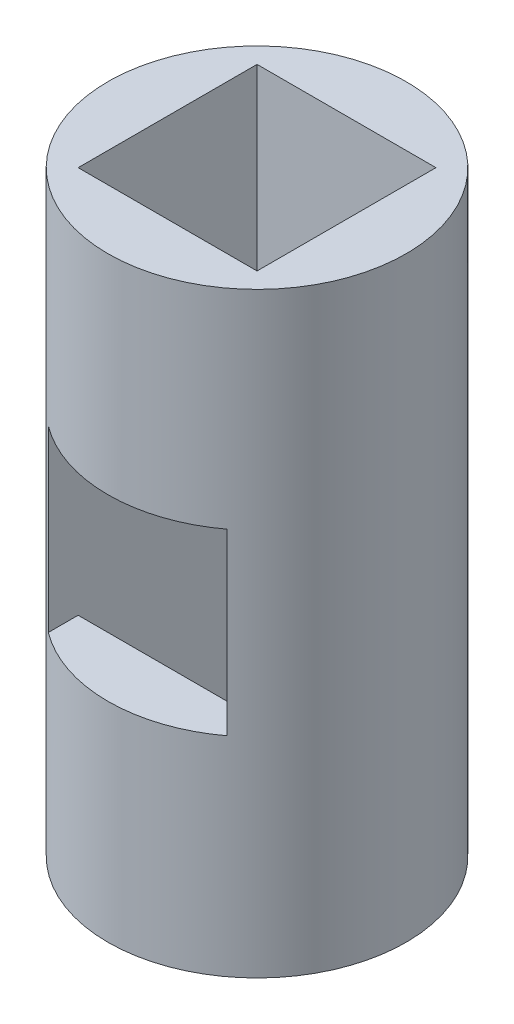
ISO-10303-21;
HEADER;
FILE_DESCRIPTION(('STEP AP214'),'2;1');
FILE_NAME('part.step','',(''),(''),'','','');
FILE_SCHEMA(('AUTOMOTIVE_DESIGN { 1 0 10303 214 1 1 1 1 }'));
ENDSEC;
DATA;
#1=APPLICATION_CONTEXT('core data for automotive mechanical design processes');
#2=APPLICATION_PROTOCOL_DEFINITION('international standard','automotive_design',2000,#1);
#3=PRODUCT_CONTEXT('',#1,'mechanical');
#4=PRODUCT('Part','Part','',(#3));
#5=PRODUCT_RELATED_PRODUCT_CATEGORY('part','',(#4));
#6=PRODUCT_DEFINITION_FORMATION('','',#4);
#7=PRODUCT_DEFINITION_CONTEXT('part definition',#1,'design');
#8=PRODUCT_DEFINITION('design','',#6,#7);
#9=PRODUCT_DEFINITION_SHAPE('','',#8);
#10=(LENGTH_UNIT() NAMED_UNIT(*) SI_UNIT(.MILLI.,.METRE.));
#11=(NAMED_UNIT(*) PLANE_ANGLE_UNIT() SI_UNIT($,.RADIAN.));
#12=(NAMED_UNIT(*) SI_UNIT($,.STERADIAN.) SOLID_ANGLE_UNIT());
#13=UNCERTAINTY_MEASURE_WITH_UNIT(LENGTH_MEASURE(1.E-05),#10,'distance_accuracy_value','');
#14=(GEOMETRIC_REPRESENTATION_CONTEXT(3) GLOBAL_UNCERTAINTY_ASSIGNED_CONTEXT((#13)) GLOBAL_UNIT_ASSIGNED_CONTEXT((#10,
#11,#12)) REPRESENTATION_CONTEXT('',''));
#15=CARTESIAN_POINT('',(0.,0.,0.));
#16=DIRECTION('',(0.,0.,1.));
#17=DIRECTION('',(1.,0.,0.));
#18=AXIS2_PLACEMENT_3D('',#15,#16,#17);
#19=CARTESIAN_POINT('',(-15.,0.,15.));
#20=DIRECTION('',(0.,0.,-1.));
#21=DIRECTION('',(-1.,0.,0.));
#22=AXIS2_PLACEMENT_3D('',#19,#20,#21);
#23=PLANE('',#22);
#24=DIRECTION('',(1.,0.,0.));
#25=VECTOR('',#24,1.);
#26=CARTESIAN_POINT('',(15.,65.,15.));
#27=LINE('',#26,#25);
#28=CARTESIAN_POINT('',(-15.,65.,15.));
#29=VERTEX_POINT('',#28);
#30=CARTESIAN_POINT('',(15.,65.,15.));
#31=VERTEX_POINT('',#30);
#32=EDGE_CURVE('E99',#29,#31,#27,.T.);
#33=ORIENTED_EDGE('',*,*,#32,.F.);
#34=DIRECTION('',(0.,1.,0.));
#35=VECTOR('',#34,1.);
#36=CARTESIAN_POINT('',(-15.,0.,15.));
#37=LINE('',#36,#35);
#38=CARTESIAN_POINT('',(-15.,100.,15.));
#39=VERTEX_POINT('',#38);
#40=EDGE_CURVE('E77',#29,#39,#37,.T.);
#41=ORIENTED_EDGE('',*,*,#40,.T.);
#42=DIRECTION('',(1.,0.,0.));
#43=VECTOR('',#42,1.);
#44=CARTESIAN_POINT('',(-15.,100.,15.));
#45=LINE('',#44,#43);
#46=CARTESIAN_POINT('',(15.,100.,15.));
#47=VERTEX_POINT('',#46);
#48=EDGE_CURVE('E224',#39,#47,#45,.T.);
#49=ORIENTED_EDGE('',*,*,#48,.T.);
#50=DIRECTION('',(0.,1.,0.));
#51=VECTOR('',#50,1.);
#52=CARTESIAN_POINT('',(15.,0.,15.));
#53=LINE('',#52,#51);
#54=EDGE_CURVE('E248',#31,#47,#53,.T.);
#55=ORIENTED_EDGE('',*,*,#54,.F.);
#56=EDGE_LOOP('',(#33,#41,#49,#55));
#57=FACE_BOUND('',#56,.T.);
#58=ADVANCED_FACE('F73',(#57),#23,.T.);
#59=CARTESIAN_POINT('',(-15.,0.,-15.));
#60=DIRECTION('',(0.,0.,1.));
#61=DIRECTION('',(1.,0.,0.));
#62=AXIS2_PLACEMENT_3D('',#59,#60,#61);
#63=PLANE('',#62);
#64=DIRECTION('',(1.,0.,0.));
#65=VECTOR('',#64,1.);
#66=CARTESIAN_POINT('',(-15.,35.,-15.));
#67=LINE('',#66,#65);
#68=CARTESIAN_POINT('',(-15.,35.,-15.));
#69=VERTEX_POINT('',#68);
#70=CARTESIAN_POINT('',(15.,35.,-15.));
#71=VERTEX_POINT('',#70);
#72=EDGE_CURVE('E210',#69,#71,#67,.T.);
#73=ORIENTED_EDGE('',*,*,#72,.F.);
#74=DIRECTION('',(0.,1.,0.));
#75=VECTOR('',#74,1.);
#76=CARTESIAN_POINT('',(-15.,0.,-15.));
#77=LINE('',#76,#75);
#78=CARTESIAN_POINT('',(-15.,0.,-15.));
#79=VERTEX_POINT('',#78);
#80=EDGE_CURVE('E247',#79,#69,#77,.T.);
#81=ORIENTED_EDGE('',*,*,#80,.F.);
#82=DIRECTION('',(1.,0.,0.));
#83=VECTOR('',#82,1.);
#84=CARTESIAN_POINT('',(-15.,0.,-15.));
#85=LINE('',#84,#83);
#86=CARTESIAN_POINT('',(15.,0.,-15.));
#87=VERTEX_POINT('',#86);
#88=EDGE_CURVE('E240',#79,#87,#85,.T.);
#89=ORIENTED_EDGE('',*,*,#88,.T.);
#90=DIRECTION('',(0.,1.,0.));
#91=VECTOR('',#90,1.);
#92=CARTESIAN_POINT('',(15.,0.,-15.));
#93=LINE('',#92,#91);
#94=EDGE_CURVE('E234',#87,#71,#93,.T.);
#95=ORIENTED_EDGE('',*,*,#94,.T.);
#96=EDGE_LOOP('',(#73,#81,#89,#95));
#97=FACE_BOUND('',#96,.T.);
#98=ADVANCED_FACE('F311',(#97),#63,.T.);
#99=CARTESIAN_POINT('',(0.,100.,0.));
#100=DIRECTION('',(0.,1.,0.));
#101=DIRECTION('',(0.,0.,1.));
#102=AXIS2_PLACEMENT_3D('',#99,#100,#101);
#103=PLANE('',#102);
#104=CARTESIAN_POINT('',(0.,100.,0.));
#105=DIRECTION('',(0.,1.,0.));
#106=DIRECTION('',(0.,0.,1.));
#107=AXIS2_PLACEMENT_3D('',#104,#105,#106);
#108=CIRCLE('',#107,25.);
#109=CARTESIAN_POINT('',(0.,100.,25.));
#110=VERTEX_POINT('',#109);
#111=EDGE_CURVE('E12',#110,#110,#108,.T.);
#112=ORIENTED_EDGE('',*,*,#111,.T.);
#113=EDGE_LOOP('',(#112));
#114=FACE_BOUND('',#113,.T.);
#115=DIRECTION('',(0.,0.,1.));
#116=VECTOR('',#115,1.);
#117=CARTESIAN_POINT('',(-15.,100.,-15.));
#118=LINE('',#117,#116);
#119=CARTESIAN_POINT('',(-15.,100.,-15.));
#120=VERTEX_POINT('',#119);
#121=EDGE_CURVE('E227',#120,#39,#118,.T.);
#122=ORIENTED_EDGE('',*,*,#121,.F.);
#123=DIRECTION('',(-1.,0.,0.));
#124=VECTOR('',#123,1.);
#125=CARTESIAN_POINT('',(-15.,100.,-15.));
#126=LINE('',#125,#124);
#127=CARTESIAN_POINT('',(15.,100.,-15.));
#128=VERTEX_POINT('',#127);
#129=EDGE_CURVE('E230',#128,#120,#126,.T.);
#130=ORIENTED_EDGE('',*,*,#129,.F.);
#131=DIRECTION('',(0.,0.,-1.));
#132=VECTOR('',#131,1.);
#133=CARTESIAN_POINT('',(15.,100.,-15.));
#134=LINE('',#133,#132);
#135=EDGE_CURVE('E254',#47,#128,#134,.T.);
#136=ORIENTED_EDGE('',*,*,#135,.F.);
#137=ORIENTED_EDGE('',*,*,#48,.F.);
#138=EDGE_LOOP('',(#122,#130,#136,#137));
#139=FACE_BOUND('',#138,.T.);
#140=ADVANCED_FACE('F294',(#114,#139),#103,.T.);
#141=CARTESIAN_POINT('',(0.,0.,0.));
#142=DIRECTION('',(0.,1.,0.));
#143=DIRECTION('',(0.,0.,1.));
#144=AXIS2_PLACEMENT_3D('',#141,#142,#143);
#145=PLANE('',#144);
#146=CARTESIAN_POINT('',(0.,0.,0.));
#147=DIRECTION('',(0.,1.,0.));
#148=DIRECTION('',(0.,0.,1.));
#149=AXIS2_PLACEMENT_3D('',#146,#147,#148);
#150=CIRCLE('',#149,25.);
#151=CARTESIAN_POINT('',(0.,0.,25.));
#152=VERTEX_POINT('',#151);
#153=EDGE_CURVE('E83',#152,#152,#150,.T.);
#154=ORIENTED_EDGE('',*,*,#153,.F.);
#155=EDGE_LOOP('',(#154));
#156=FACE_BOUND('',#155,.T.);
#157=ORIENTED_EDGE('',*,*,#88,.F.);
#158=DIRECTION('',(0.,0.,-1.));
#159=VECTOR('',#158,1.);
#160=CARTESIAN_POINT('',(-15.,0.,-15.));
#161=LINE('',#160,#159);
#162=CARTESIAN_POINT('',(-15.,0.,15.));
#163=VERTEX_POINT('',#162);
#164=EDGE_CURVE('E279',#163,#79,#161,.T.);
#165=ORIENTED_EDGE('',*,*,#164,.F.);
#166=DIRECTION('',(-1.,0.,0.));
#167=VECTOR('',#166,1.);
#168=CARTESIAN_POINT('',(-15.,0.,15.));
#169=LINE('',#168,#167);
#170=CARTESIAN_POINT('',(15.,0.,15.));
#171=VERTEX_POINT('',#170);
#172=EDGE_CURVE('E261',#171,#163,#169,.T.);
#173=ORIENTED_EDGE('',*,*,#172,.F.);
#174=DIRECTION('',(0.,0.,1.));
#175=VECTOR('',#174,1.);
#176=CARTESIAN_POINT('',(15.,0.,-15.));
#177=LINE('',#176,#175);
#178=EDGE_CURVE('E256',#87,#171,#177,.T.);
#179=ORIENTED_EDGE('',*,*,#178,.F.);
#180=EDGE_LOOP('',(#157,#165,#173,#179));
#181=FACE_BOUND('',#180,.T.);
#182=ADVANCED_FACE('F338',(#156,#181),#145,.F.);
#183=CARTESIAN_POINT('',(0.,100.,0.));
#184=DIRECTION('',(0.,-1.,0.));
#185=DIRECTION('',(0.,0.,-1.));
#186=AXIS2_PLACEMENT_3D('',#183,#184,#185);
#187=CYLINDRICAL_SURFACE('',#186,25.);
#188=CARTESIAN_POINT('',(0.,65.,0.));
#189=DIRECTION('',(0.,1.,0.));
#190=DIRECTION('',(0.,0.,1.));
#191=AXIS2_PLACEMENT_3D('',#188,#189,#190);
#192=CIRCLE('',#191,25.);
#193=CARTESIAN_POINT('',(15.,65.,20.));
#194=VERTEX_POINT('',#193);
#195=CARTESIAN_POINT('',(-15.,65.,20.));
#196=VERTEX_POINT('',#195);
#197=EDGE_CURVE('E188',#194,#196,#192,.F.);
#198=ORIENTED_EDGE('',*,*,#197,.F.);
#199=DIRECTION('',(0.,-1.,0.));
#200=VECTOR('',#199,1.);
#201=CARTESIAN_POINT('',(15.,100.,20.));
#202=LINE('',#201,#200);
#203=CARTESIAN_POINT('',(15.,35.,20.));
#204=VERTEX_POINT('',#203);
#205=EDGE_CURVE('E170',#204,#194,#202,.F.);
#206=ORIENTED_EDGE('',*,*,#205,.F.);
#207=CARTESIAN_POINT('',(0.,35.,0.));
#208=DIRECTION('',(0.,-1.,0.));
#209=DIRECTION('',(0.,0.,-1.));
#210=AXIS2_PLACEMENT_3D('',#207,#208,#209);
#211=CIRCLE('',#210,25.);
#212=CARTESIAN_POINT('',(-15.,35.,20.));
#213=VERTEX_POINT('',#212);
#214=EDGE_CURVE('E180',#213,#204,#211,.F.);
#215=ORIENTED_EDGE('',*,*,#214,.F.);
#216=DIRECTION('',(0.,-1.,0.));
#217=VECTOR('',#216,1.);
#218=CARTESIAN_POINT('',(-15.,100.,20.));
#219=LINE('',#218,#217);
#220=EDGE_CURVE('E91',#196,#213,#219,.T.);
#221=ORIENTED_EDGE('',*,*,#220,.F.);
#222=EDGE_LOOP('',(#198,#206,#215,#221));
#223=FACE_BOUND('',#222,.T.);
#224=CARTESIAN_POINT('',(0.,35.,0.));
#225=DIRECTION('',(0.,-1.,0.));
#226=DIRECTION('',(0.,0.,-1.));
#227=AXIS2_PLACEMENT_3D('',#224,#225,#226);
#228=CIRCLE('',#227,25.);
#229=CARTESIAN_POINT('',(15.,35.,-20.));
#230=VERTEX_POINT('',#229);
#231=CARTESIAN_POINT('',(-15.,35.,-20.));
#232=VERTEX_POINT('',#231);
#233=EDGE_CURVE('E201',#230,#232,#228,.F.);
#234=ORIENTED_EDGE('',*,*,#233,.F.);
#235=DIRECTION('',(0.,-1.,0.));
#236=VECTOR('',#235,1.);
#237=CARTESIAN_POINT('',(15.,100.,-20.));
#238=LINE('',#237,#236);
#239=CARTESIAN_POINT('',(15.,65.,-20.));
#240=VERTEX_POINT('',#239);
#241=EDGE_CURVE('E204',#240,#230,#238,.T.);
#242=ORIENTED_EDGE('',*,*,#241,.F.);
#243=CARTESIAN_POINT('',(0.,65.,0.));
#244=DIRECTION('',(0.,1.,0.));
#245=DIRECTION('',(0.,0.,1.));
#246=AXIS2_PLACEMENT_3D('',#243,#244,#245);
#247=CIRCLE('',#246,25.);
#248=CARTESIAN_POINT('',(-15.,65.,-20.));
#249=VERTEX_POINT('',#248);
#250=EDGE_CURVE('E216',#249,#240,#247,.F.);
#251=ORIENTED_EDGE('',*,*,#250,.F.);
#252=DIRECTION('',(0.,-1.,0.));
#253=VECTOR('',#252,1.);
#254=CARTESIAN_POINT('',(-15.,100.,-20.));
#255=LINE('',#254,#253);
#256=EDGE_CURVE('E183',#232,#249,#255,.F.);
#257=ORIENTED_EDGE('',*,*,#256,.F.);
#258=EDGE_LOOP('',(#234,#242,#251,#257));
#259=FACE_BOUND('',#258,.T.);
#260=ORIENTED_EDGE('',*,*,#111,.F.);
#261=EDGE_LOOP('',(#260));
#262=FACE_BOUND('',#261,.T.);
#263=ORIENTED_EDGE('',*,*,#153,.T.);
#264=EDGE_LOOP('',(#263));
#265=FACE_BOUND('',#264,.T.);
#266=ADVANCED_FACE('F75',(#223,#259,#262,#265),#187,.T.);
#267=DIRECTION('',(-1.,0.,0.));
#268=VECTOR('',#267,1.);
#269=CARTESIAN_POINT('',(-15.,65.,-15.));
#270=LINE('',#269,#268);
#271=CARTESIAN_POINT('',(15.,65.,-15.));
#272=VERTEX_POINT('',#271);
#273=CARTESIAN_POINT('',(-15.,65.,-15.));
#274=VERTEX_POINT('',#273);
#275=EDGE_CURVE('E207',#272,#274,#270,.T.);
#276=ORIENTED_EDGE('',*,*,#275,.F.);
#277=EDGE_CURVE('E237',#272,#128,#93,.T.);
#278=ORIENTED_EDGE('',*,*,#277,.T.);
#279=ORIENTED_EDGE('',*,*,#129,.T.);
#280=EDGE_CURVE('E233',#274,#120,#77,.T.);
#281=ORIENTED_EDGE('',*,*,#280,.F.);
#282=EDGE_LOOP('',(#276,#278,#279,#281));
#283=FACE_BOUND('',#282,.T.);
#284=ADVANCED_FACE('F298',(#283),#63,.T.);
#285=CARTESIAN_POINT('',(-15.,0.,-15.));
#286=DIRECTION('',(1.,0.,0.));
#287=DIRECTION('',(0.,0.,-1.));
#288=AXIS2_PLACEMENT_3D('',#285,#286,#287);
#289=PLANE('',#288);
#290=ORIENTED_EDGE('',*,*,#121,.T.);
#291=ORIENTED_EDGE('',*,*,#40,.F.);
#292=DIRECTION('',(0.,0.,-1.));
#293=VECTOR('',#292,1.);
#294=CARTESIAN_POINT('',(-15.,65.,25.001));
#295=LINE('',#294,#293);
#296=EDGE_CURVE('E197',#196,#29,#295,.T.);
#297=ORIENTED_EDGE('',*,*,#296,.F.);
#298=ORIENTED_EDGE('',*,*,#220,.T.);
#299=DIRECTION('',(0.,0.,-1.));
#300=VECTOR('',#299,1.);
#301=CARTESIAN_POINT('',(-15.,35.,25.001));
#302=LINE('',#301,#300);
#303=CARTESIAN_POINT('',(-15.,35.,15.));
#304=VERTEX_POINT('',#303);
#305=EDGE_CURVE('E177',#213,#304,#302,.T.);
#306=ORIENTED_EDGE('',*,*,#305,.T.);
#307=EDGE_CURVE('E277',#163,#304,#37,.T.);
#308=ORIENTED_EDGE('',*,*,#307,.F.);
#309=ORIENTED_EDGE('',*,*,#164,.T.);
#310=ORIENTED_EDGE('',*,*,#80,.T.);
#311=DIRECTION('',(0.,0.,1.));
#312=VECTOR('',#311,1.);
#313=CARTESIAN_POINT('',(-15.,35.,-25.001));
#314=LINE('',#313,#312);
#315=EDGE_CURVE('E217',#232,#69,#314,.T.);
#316=ORIENTED_EDGE('',*,*,#315,.F.);
#317=ORIENTED_EDGE('',*,*,#256,.T.);
#318=DIRECTION('',(0.,0.,1.));
#319=VECTOR('',#318,1.);
#320=CARTESIAN_POINT('',(-15.,65.,-25.001));
#321=LINE('',#320,#319);
#322=EDGE_CURVE('E219',#249,#274,#321,.T.);
#323=ORIENTED_EDGE('',*,*,#322,.T.);
#324=ORIENTED_EDGE('',*,*,#280,.T.);
#325=EDGE_LOOP('',(#290,#291,#297,#298,#306,#308,#309,#310,#316,#317,#323,#324));
#326=FACE_BOUND('',#325,.T.);
#327=ADVANCED_FACE('F313',(#326),#289,.T.);
#328=DIRECTION('',(-1.,0.,0.));
#329=VECTOR('',#328,1.);
#330=CARTESIAN_POINT('',(15.,35.,15.));
#331=LINE('',#330,#329);
#332=CARTESIAN_POINT('',(15.,35.,15.));
#333=VERTEX_POINT('',#332);
#334=EDGE_CURVE('E189',#333,#304,#331,.T.);
#335=ORIENTED_EDGE('',*,*,#334,.F.);
#336=EDGE_CURVE('E173',#171,#333,#53,.T.);
#337=ORIENTED_EDGE('',*,*,#336,.F.);
#338=ORIENTED_EDGE('',*,*,#172,.T.);
#339=ORIENTED_EDGE('',*,*,#307,.T.);
#340=EDGE_LOOP('',(#335,#337,#338,#339));
#341=FACE_BOUND('',#340,.T.);
#342=ADVANCED_FACE('F325',(#341),#23,.T.);
#343=CARTESIAN_POINT('',(15.,0.,-15.));
#344=DIRECTION('',(-1.,0.,0.));
#345=DIRECTION('',(0.,0.,1.));
#346=AXIS2_PLACEMENT_3D('',#343,#344,#345);
#347=PLANE('',#346);
#348=ORIENTED_EDGE('',*,*,#135,.T.);
#349=ORIENTED_EDGE('',*,*,#277,.F.);
#350=DIRECTION('',(0.,0.,1.));
#351=VECTOR('',#350,1.);
#352=CARTESIAN_POINT('',(15.,65.,-25.001));
#353=LINE('',#352,#351);
#354=EDGE_CURVE('E212',#240,#272,#353,.T.);
#355=ORIENTED_EDGE('',*,*,#354,.F.);
#356=ORIENTED_EDGE('',*,*,#241,.T.);
#357=DIRECTION('',(0.,0.,1.));
#358=VECTOR('',#357,1.);
#359=CARTESIAN_POINT('',(15.,35.,-25.001));
#360=LINE('',#359,#358);
#361=EDGE_CURVE('E213',#230,#71,#360,.T.);
#362=ORIENTED_EDGE('',*,*,#361,.T.);
#363=ORIENTED_EDGE('',*,*,#94,.F.);
#364=ORIENTED_EDGE('',*,*,#178,.T.);
#365=ORIENTED_EDGE('',*,*,#336,.T.);
#366=DIRECTION('',(0.,0.,-1.));
#367=VECTOR('',#366,1.);
#368=CARTESIAN_POINT('',(15.,35.,25.001));
#369=LINE('',#368,#367);
#370=EDGE_CURVE('E165',#204,#333,#369,.T.);
#371=ORIENTED_EDGE('',*,*,#370,.F.);
#372=ORIENTED_EDGE('',*,*,#205,.T.);
#373=DIRECTION('',(0.,0.,-1.));
#374=VECTOR('',#373,1.);
#375=CARTESIAN_POINT('',(15.,65.,25.001));
#376=LINE('',#375,#374);
#377=EDGE_CURVE('E184',#194,#31,#376,.T.);
#378=ORIENTED_EDGE('',*,*,#377,.T.);
#379=ORIENTED_EDGE('',*,*,#54,.T.);
#380=EDGE_LOOP('',(#348,#349,#355,#356,#362,#363,#364,#365,#371,#372,#378,#379));
#381=FACE_BOUND('',#380,.T.);
#382=ADVANCED_FACE('F168',(#381),#347,.T.);
#383=CARTESIAN_POINT('',(-15.,35.,-25.001));
#384=DIRECTION('',(0.,-1.,0.));
#385=DIRECTION('',(0.,0.,-1.));
#386=AXIS2_PLACEMENT_3D('',#383,#384,#385);
#387=PLANE('',#386);
#388=ORIENTED_EDGE('',*,*,#233,.T.);
#389=ORIENTED_EDGE('',*,*,#315,.T.);
#390=ORIENTED_EDGE('',*,*,#72,.T.);
#391=ORIENTED_EDGE('',*,*,#361,.F.);
#392=EDGE_LOOP('',(#388,#389,#390,#391));
#393=FACE_BOUND('',#392,.T.);
#394=ADVANCED_FACE('F308',(#393),#387,.F.);
#395=CARTESIAN_POINT('',(-15.,65.,-25.001));
#396=DIRECTION('',(0.,1.,0.));
#397=DIRECTION('',(0.,0.,1.));
#398=AXIS2_PLACEMENT_3D('',#395,#396,#397);
#399=PLANE('',#398);
#400=ORIENTED_EDGE('',*,*,#250,.T.);
#401=ORIENTED_EDGE('',*,*,#354,.T.);
#402=ORIENTED_EDGE('',*,*,#275,.T.);
#403=ORIENTED_EDGE('',*,*,#322,.F.);
#404=EDGE_LOOP('',(#400,#401,#402,#403));
#405=FACE_BOUND('',#404,.T.);
#406=ADVANCED_FACE('F304',(#405),#399,.F.);
#407=CARTESIAN_POINT('',(15.,65.,25.001));
#408=DIRECTION('',(0.,1.,0.));
#409=DIRECTION('',(0.,0.,1.));
#410=AXIS2_PLACEMENT_3D('',#407,#408,#409);
#411=PLANE('',#410);
#412=ORIENTED_EDGE('',*,*,#197,.T.);
#413=ORIENTED_EDGE('',*,*,#296,.T.);
#414=ORIENTED_EDGE('',*,*,#32,.T.);
#415=ORIENTED_EDGE('',*,*,#377,.F.);
#416=EDGE_LOOP('',(#412,#413,#414,#415));
#417=FACE_BOUND('',#416,.T.);
#418=ADVANCED_FACE('F314',(#417),#411,.F.);
#419=CARTESIAN_POINT('',(15.,35.,25.001));
#420=DIRECTION('',(0.,-1.,0.));
#421=DIRECTION('',(0.,0.,-1.));
#422=AXIS2_PLACEMENT_3D('',#419,#420,#421);
#423=PLANE('',#422);
#424=ORIENTED_EDGE('',*,*,#214,.T.);
#425=ORIENTED_EDGE('',*,*,#370,.T.);
#426=ORIENTED_EDGE('',*,*,#334,.T.);
#427=ORIENTED_EDGE('',*,*,#305,.F.);
#428=EDGE_LOOP('',(#424,#425,#426,#427));
#429=FACE_BOUND('',#428,.T.);
#430=ADVANCED_FACE('F181',(#429),#423,.F.);
#431=CLOSED_SHELL('',(#58,#98,#140,#182,#266,#284,#327,#342,#382,#394,#406,#418,#430));
#432=MANIFOLD_SOLID_BREP('B2',#431);
#433=ADVANCED_BREP_SHAPE_REPRESENTATION('',(#18,#432),#14);
#434=SHAPE_DEFINITION_REPRESENTATION(#9,#433);
ENDSEC;
END-ISO-10303-21;
